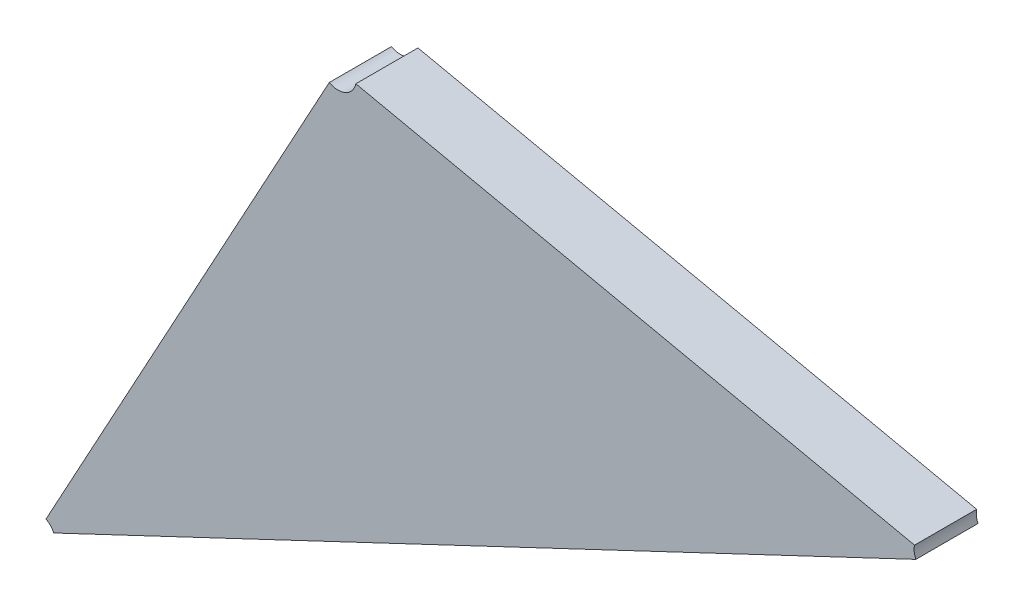
ISO-10303-21;
HEADER;
FILE_DESCRIPTION(('STEP AP214'),'2;1');
FILE_NAME('part.step','',(''),(''),'','','');
FILE_SCHEMA(('AUTOMOTIVE_DESIGN { 1 0 10303 214 1 1 1 1 }'));
ENDSEC;
DATA;
#1=APPLICATION_CONTEXT('core data for automotive mechanical design processes');
#2=APPLICATION_PROTOCOL_DEFINITION('international standard','automotive_design',2000,#1);
#3=PRODUCT_CONTEXT('',#1,'mechanical');
#4=PRODUCT('Part','Part','',(#3));
#5=PRODUCT_RELATED_PRODUCT_CATEGORY('part','',(#4));
#6=PRODUCT_DEFINITION_FORMATION('','',#4);
#7=PRODUCT_DEFINITION_CONTEXT('part definition',#1,'design');
#8=PRODUCT_DEFINITION('design','',#6,#7);
#9=PRODUCT_DEFINITION_SHAPE('','',#8);
#10=(LENGTH_UNIT() NAMED_UNIT(*) SI_UNIT(.MILLI.,.METRE.));
#11=(NAMED_UNIT(*) PLANE_ANGLE_UNIT() SI_UNIT($,.RADIAN.));
#12=(NAMED_UNIT(*) SI_UNIT($,.STERADIAN.) SOLID_ANGLE_UNIT());
#13=UNCERTAINTY_MEASURE_WITH_UNIT(LENGTH_MEASURE(1.E-05),#10,'distance_accuracy_value','');
#14=(GEOMETRIC_REPRESENTATION_CONTEXT(3) GLOBAL_UNCERTAINTY_ASSIGNED_CONTEXT((#13)) GLOBAL_UNIT_ASSIGNED_CONTEXT((#10,
#11,#12)) REPRESENTATION_CONTEXT('',''));
#15=CARTESIAN_POINT('',(0.,0.,0.));
#16=DIRECTION('',(0.,0.,1.));
#17=DIRECTION('',(1.,0.,0.));
#18=AXIS2_PLACEMENT_3D('',#15,#16,#17);
#19=CARTESIAN_POINT('',(-1.69935941857164,-1.40831289575818,0.0042));
#20=DIRECTION('',(0.,0.,1.));
#21=DIRECTION('',(1.,0.,0.));
#22=AXIS2_PLACEMENT_3D('',#19,#20,#21);
#23=PLANE('',#22);
#24=CARTESIAN_POINT('',(-1.71069826462096,-1.38144679395879,0.0042));
#25=DIRECTION('',(0.,0.,-1.));
#26=DIRECTION('',(0.977619939968983,-0.210378832050762,0.));
#27=AXIS2_PLACEMENT_3D('',#24,#25,#26);
#28=CIRCLE('',#27,0.002);
#29=CARTESIAN_POINT('',(-1.70874302474103,-1.38186755162289,0.0042));
#30=VERTEX_POINT('',#29);
#31=CARTESIAN_POINT('',(-1.71165544141053,-1.38320287271372,0.0042));
#32=VERTEX_POINT('',#31);
#33=EDGE_CURVE('E11',#30,#32,#28,.T.);
#34=ORIENTED_EDGE('',*,*,#33,.T.);
#35=DIRECTION('',(-0.478588394782358,-0.878039377465296,0.));
#36=VECTOR('',#35,1.);
#37=CARTESIAN_POINT('',(-1.71165544141053,-1.38320287271372,0.0042));
#38=LINE('',#37,#36);
#39=CARTESIAN_POINT('',(-1.74266315114509,-1.4400909846044,0.0042));
#40=VERTEX_POINT('',#39);
#41=EDGE_CURVE('E34',#32,#40,#38,.T.);
#42=ORIENTED_EDGE('',*,*,#41,.T.);
#43=CARTESIAN_POINT('',(-1.74362032793465,-1.44184706335933,0.0042));
#44=DIRECTION('',(0.,0.,-1.));
#45=DIRECTION('',(0.478588394780703,0.878039377466199,0.));
#46=AXIS2_PLACEMENT_3D('',#43,#44,#45);
#47=CIRCLE('',#46,0.00199999999999999);
#48=CARTESIAN_POINT('',(-1.7418127151387,-1.44099118020147,0.0042));
#49=VERTEX_POINT('',#48);
#50=EDGE_CURVE('E86',#40,#49,#47,.T.);
#51=ORIENTED_EDGE('',*,*,#50,.T.);
#52=DIRECTION('',(0.903806397975919,0.42794157893081,0.));
#53=VECTOR('',#52,1.);
#54=CARTESIAN_POINT('',(-1.7418127151387,-1.44099118020147,0.0042));
#55=LINE('',#54,#53);
#56=CARTESIAN_POINT('',(-1.64743666092601,-1.39630524110711,0.0042));
#57=VERTEX_POINT('',#56);
#58=EDGE_CURVE('E105',#49,#57,#55,.T.);
#59=ORIENTED_EDGE('',*,*,#58,.T.);
#60=CARTESIAN_POINT('',(-1.64562904813006,-1.39544935794925,0.0042));
#61=DIRECTION('',(0.,0.,-1.));
#62=DIRECTION('',(-0.903806397976061,-0.427941578930511,0.));
#63=AXIS2_PLACEMENT_3D('',#60,#61,#62);
#64=CIRCLE('',#63,0.00200000000000003);
#65=CARTESIAN_POINT('',(-1.64758428801,-1.39502860028515,0.0042));
#66=VERTEX_POINT('',#65);
#67=EDGE_CURVE('E110',#57,#66,#64,.T.);
#68=ORIENTED_EDGE('',*,*,#67,.T.);
#69=DIRECTION('',(-0.977619939969144,0.210378832050012,0.));
#70=VECTOR('',#69,1.);
#71=CARTESIAN_POINT('',(-1.64758428801,-1.39502860028515,0.0042));
#72=LINE('',#71,#70);
#73=EDGE_CURVE('E85',#66,#30,#72,.T.);
#74=ORIENTED_EDGE('',*,*,#73,.T.);
#75=EDGE_LOOP('',(#34,#42,#51,#59,#68,#74));
#76=FACE_BOUND('',#75,.T.);
#77=ADVANCED_FACE('F17',(#76),#23,.T.);
#78=CARTESIAN_POINT('',(-1.71069826462096,-1.38144679395879,-0.0018));
#79=DIRECTION('',(0.,0.,1.));
#80=DIRECTION('',(-1.,0.,0.));
#81=AXIS2_PLACEMENT_3D('',#78,#79,#80);
#82=CYLINDRICAL_SURFACE('',#81,0.002);
#83=DIRECTION('',(0.,0.,-1.));
#84=VECTOR('',#83,1.);
#85=CARTESIAN_POINT('',(-1.71165544141053,-1.38320287271372,0.0042));
#86=LINE('',#85,#84);
#87=CARTESIAN_POINT('',(-1.71165544141053,-1.38320287271372,-0.0026));
#88=VERTEX_POINT('',#87);
#89=EDGE_CURVE('E24',#32,#88,#86,.T.);
#90=ORIENTED_EDGE('',*,*,#89,.F.);
#91=ORIENTED_EDGE('',*,*,#33,.F.);
#92=DIRECTION('',(0.,0.,1.));
#93=VECTOR('',#92,1.);
#94=CARTESIAN_POINT('',(-1.70874302474103,-1.38186755162289,-0.0026));
#95=LINE('',#94,#93);
#96=CARTESIAN_POINT('',(-1.70874302474103,-1.38186755162289,-0.0026));
#97=VERTEX_POINT('',#96);
#98=EDGE_CURVE('E108',#97,#30,#95,.T.);
#99=ORIENTED_EDGE('',*,*,#98,.F.);
#100=CARTESIAN_POINT('',(-1.71069826462096,-1.38144679395879,-0.0026));
#101=DIRECTION('',(0.,0.,1.));
#102=DIRECTION('',(-0.478588394784538,-0.878039377464108,0.));
#103=AXIS2_PLACEMENT_3D('',#100,#101,#102);
#104=CIRCLE('',#103,0.002);
#105=EDGE_CURVE('E91',#88,#97,#104,.T.);
#106=ORIENTED_EDGE('',*,*,#105,.F.);
#107=EDGE_LOOP('',(#90,#91,#99,#106));
#108=FACE_BOUND('',#107,.T.);
#109=ADVANCED_FACE('F128',(#108),#82,.F.);
#110=CARTESIAN_POINT('',(-1.64562904813006,-1.39544935794925,-0.0018));
#111=DIRECTION('',(0.,0.,1.));
#112=DIRECTION('',(-1.,0.,0.));
#113=AXIS2_PLACEMENT_3D('',#110,#111,#112);
#114=CYLINDRICAL_SURFACE('',#113,0.00200000000000003);
#115=DIRECTION('',(0.,0.,-1.));
#116=VECTOR('',#115,1.);
#117=CARTESIAN_POINT('',(-1.64758428801,-1.39502860028515,0.0042));
#118=LINE('',#117,#116);
#119=CARTESIAN_POINT('',(-1.64758428801,-1.39502860028515,-0.0026));
#120=VERTEX_POINT('',#119);
#121=EDGE_CURVE('E68',#66,#120,#118,.T.);
#122=ORIENTED_EDGE('',*,*,#121,.F.);
#123=ORIENTED_EDGE('',*,*,#67,.F.);
#124=DIRECTION('',(0.,0.,1.));
#125=VECTOR('',#124,1.);
#126=CARTESIAN_POINT('',(-1.64743666092601,-1.39630524110711,-0.0026));
#127=LINE('',#126,#125);
#128=CARTESIAN_POINT('',(-1.64743666092601,-1.39630524110711,-0.0026));
#129=VERTEX_POINT('',#128);
#130=EDGE_CURVE('E71',#129,#57,#127,.T.);
#131=ORIENTED_EDGE('',*,*,#130,.F.);
#132=CARTESIAN_POINT('',(-1.64562904813006,-1.39544935794925,-0.0026));
#133=DIRECTION('',(0.,0.,1.));
#134=DIRECTION('',(-0.977619939969198,0.210378832049761,0.));
#135=AXIS2_PLACEMENT_3D('',#132,#133,#134);
#136=CIRCLE('',#135,0.00200000000000003);
#137=EDGE_CURVE('E65',#120,#129,#136,.T.);
#138=ORIENTED_EDGE('',*,*,#137,.F.);
#139=EDGE_LOOP('',(#122,#123,#131,#138));
#140=FACE_BOUND('',#139,.T.);
#141=ADVANCED_FACE('F67',(#140),#114,.F.);
#142=CARTESIAN_POINT('',(-1.74362032793465,-1.44184706335933,-0.0018));
#143=DIRECTION('',(0.,0.,1.));
#144=DIRECTION('',(-1.,0.,0.));
#145=AXIS2_PLACEMENT_3D('',#142,#143,#144);
#146=CYLINDRICAL_SURFACE('',#145,0.00199999999999999);
#147=DIRECTION('',(0.,0.,1.));
#148=VECTOR('',#147,1.);
#149=CARTESIAN_POINT('',(-1.74266315114509,-1.4400909846044,-0.0026));
#150=LINE('',#149,#148);
#151=CARTESIAN_POINT('',(-1.74266315114509,-1.4400909846044,-0.0026));
#152=VERTEX_POINT('',#151);
#153=EDGE_CURVE('E112',#152,#40,#150,.T.);
#154=ORIENTED_EDGE('',*,*,#153,.F.);
#155=CARTESIAN_POINT('',(-1.74362032793465,-1.44184706335933,-0.0026));
#156=DIRECTION('',(0.,0.,1.));
#157=DIRECTION('',(0.903806397976104,0.42794157893042,0.));
#158=AXIS2_PLACEMENT_3D('',#155,#156,#157);
#159=CIRCLE('',#158,0.00199999999999999);
#160=CARTESIAN_POINT('',(-1.7418127151387,-1.44099118020147,-0.0026));
#161=VERTEX_POINT('',#160);
#162=EDGE_CURVE('E102',#161,#152,#159,.T.);
#163=ORIENTED_EDGE('',*,*,#162,.F.);
#164=DIRECTION('',(0.,0.,1.));
#165=VECTOR('',#164,1.);
#166=CARTESIAN_POINT('',(-1.7418127151387,-1.44099118020147,-0.0026));
#167=LINE('',#166,#165);
#168=EDGE_CURVE('E76',#161,#49,#167,.T.);
#169=ORIENTED_EDGE('',*,*,#168,.T.);
#170=ORIENTED_EDGE('',*,*,#50,.F.);
#171=EDGE_LOOP('',(#154,#163,#169,#170));
#172=FACE_BOUND('',#171,.T.);
#173=ADVANCED_FACE('F123',(#172),#146,.F.);
#174=CARTESIAN_POINT('',(-1.71069826462096,-1.38144679395879,-0.0026));
#175=DIRECTION('',(-0.210378832050013,-0.977619939969144,0.));
#176=DIRECTION('',(0.977619939969144,-0.210378832050013,0.));
#177=AXIS2_PLACEMENT_3D('',#174,#175,#176);
#178=PLANE('',#177);
#179=ORIENTED_EDGE('',*,*,#98,.T.);
#180=ORIENTED_EDGE('',*,*,#73,.F.);
#181=ORIENTED_EDGE('',*,*,#121,.T.);
#182=DIRECTION('',(0.977619939969144,-0.210378832050011,0.));
#183=VECTOR('',#182,1.);
#184=CARTESIAN_POINT('',(-1.70874302474103,-1.38186755162289,-0.0026));
#185=LINE('',#184,#183);
#186=EDGE_CURVE('E84',#97,#120,#185,.T.);
#187=ORIENTED_EDGE('',*,*,#186,.F.);
#188=EDGE_LOOP('',(#179,#180,#181,#187));
#189=FACE_BOUND('',#188,.T.);
#190=ADVANCED_FACE('F83',(#189),#178,.F.);
#191=CARTESIAN_POINT('',(-1.64562904813006,-1.39544935794925,-0.0026));
#192=DIRECTION('',(-0.427941578930813,0.903806397975918,0.));
#193=DIRECTION('',(-0.903806397975918,-0.427941578930813,0.));
#194=AXIS2_PLACEMENT_3D('',#191,#192,#193);
#195=PLANE('',#194);
#196=ORIENTED_EDGE('',*,*,#130,.T.);
#197=ORIENTED_EDGE('',*,*,#58,.F.);
#198=ORIENTED_EDGE('',*,*,#168,.F.);
#199=DIRECTION('',(-0.903806397975918,-0.427941578930811,0.));
#200=VECTOR('',#199,1.);
#201=CARTESIAN_POINT('',(-1.64743666092601,-1.39630524110711,-0.0026));
#202=LINE('',#201,#200);
#203=EDGE_CURVE('E92',#129,#161,#202,.T.);
#204=ORIENTED_EDGE('',*,*,#203,.F.);
#205=EDGE_LOOP('',(#196,#197,#198,#204));
#206=FACE_BOUND('',#205,.T.);
#207=ADVANCED_FACE('F126',(#206),#195,.F.);
#208=CARTESIAN_POINT('',(-1.74362032793465,-1.44184706335933,-0.0026));
#209=DIRECTION('',(0.878039377465294,-0.478588394782364,0.));
#210=DIRECTION('',(0.478588394782364,0.878039377465294,0.));
#211=AXIS2_PLACEMENT_3D('',#208,#209,#210);
#212=PLANE('',#211);
#213=ORIENTED_EDGE('',*,*,#89,.T.);
#214=DIRECTION('',(0.478588394782365,0.878039377465293,0.));
#215=VECTOR('',#214,1.);
#216=CARTESIAN_POINT('',(-1.74266315114509,-1.4400909846044,-0.0026));
#217=LINE('',#216,#215);
#218=EDGE_CURVE('E77',#152,#88,#217,.T.);
#219=ORIENTED_EDGE('',*,*,#218,.F.);
#220=ORIENTED_EDGE('',*,*,#153,.T.);
#221=ORIENTED_EDGE('',*,*,#41,.F.);
#222=EDGE_LOOP('',(#213,#219,#220,#221));
#223=FACE_BOUND('',#222,.T.);
#224=ADVANCED_FACE('F119',(#223),#212,.F.);
#225=CARTESIAN_POINT('',(-1.69931119469387,-1.40842665404409,-0.0026));
#226=DIRECTION('',(0.,0.,-1.));
#227=DIRECTION('',(-1.,0.,0.));
#228=AXIS2_PLACEMENT_3D('',#225,#226,#227);
#229=PLANE('',#228);
#230=ORIENTED_EDGE('',*,*,#105,.T.);
#231=ORIENTED_EDGE('',*,*,#186,.T.);
#232=ORIENTED_EDGE('',*,*,#137,.T.);
#233=ORIENTED_EDGE('',*,*,#203,.T.);
#234=ORIENTED_EDGE('',*,*,#162,.T.);
#235=ORIENTED_EDGE('',*,*,#218,.T.);
#236=EDGE_LOOP('',(#230,#231,#232,#233,#234,#235));
#237=FACE_BOUND('',#236,.T.);
#238=ADVANCED_FACE('F89',(#237),#229,.T.);
#239=CLOSED_SHELL('',(#77,#109,#141,#173,#190,#207,#224,#238));
#240=MANIFOLD_SOLID_BREP('B1',#239);
#241=ADVANCED_BREP_SHAPE_REPRESENTATION('',(#18,#240),#14);
#242=SHAPE_DEFINITION_REPRESENTATION(#9,#241);
ENDSEC;
END-ISO-10303-21;
